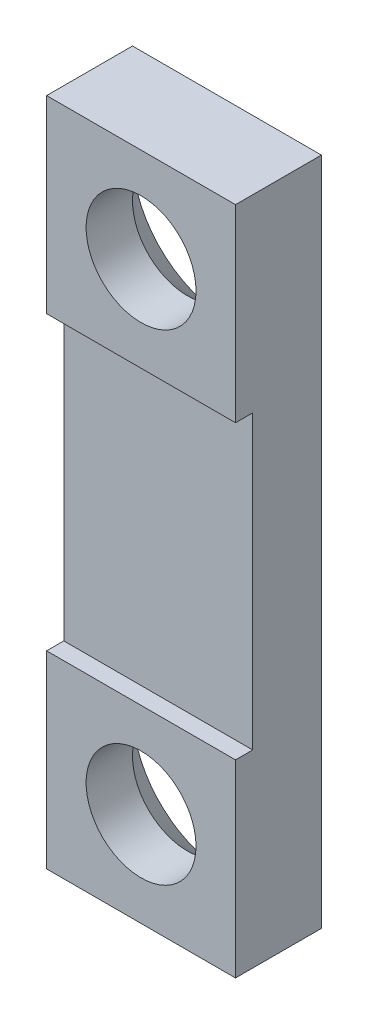
ISO-10303-21;
HEADER;
FILE_DESCRIPTION(('STEP AP214'),'2;1');
FILE_NAME('part.step','',(''),(''),'','','');
FILE_SCHEMA(('AUTOMOTIVE_DESIGN { 1 0 10303 214 1 1 1 1 }'));
ENDSEC;
DATA;
#1=APPLICATION_CONTEXT('core data for automotive mechanical design processes');
#2=APPLICATION_PROTOCOL_DEFINITION('international standard','automotive_design',2000,#1);
#3=PRODUCT_CONTEXT('',#1,'mechanical');
#4=PRODUCT('Part','Part','',(#3));
#5=PRODUCT_RELATED_PRODUCT_CATEGORY('part','',(#4));
#6=PRODUCT_DEFINITION_FORMATION('','',#4);
#7=PRODUCT_DEFINITION_CONTEXT('part definition',#1,'design');
#8=PRODUCT_DEFINITION('design','',#6,#7);
#9=PRODUCT_DEFINITION_SHAPE('','',#8);
#10=(LENGTH_UNIT() NAMED_UNIT(*) SI_UNIT(.MILLI.,.METRE.));
#11=(NAMED_UNIT(*) PLANE_ANGLE_UNIT() SI_UNIT($,.RADIAN.));
#12=(NAMED_UNIT(*) SI_UNIT($,.STERADIAN.) SOLID_ANGLE_UNIT());
#13=UNCERTAINTY_MEASURE_WITH_UNIT(LENGTH_MEASURE(1.E-05),#10,'distance_accuracy_value','');
#14=(GEOMETRIC_REPRESENTATION_CONTEXT(3) GLOBAL_UNCERTAINTY_ASSIGNED_CONTEXT((#13)) GLOBAL_UNIT_ASSIGNED_CONTEXT((#10,
#11,#12)) REPRESENTATION_CONTEXT('',''));
#15=CARTESIAN_POINT('',(0.,0.,0.));
#16=DIRECTION('',(0.,0.,1.));
#17=DIRECTION('',(1.,0.,0.));
#18=AXIS2_PLACEMENT_3D('',#15,#16,#17);
#19=CARTESIAN_POINT('',(0.,0.,0.));
#20=DIRECTION('',(0.,0.,1.));
#21=DIRECTION('',(1.,0.,0.));
#22=AXIS2_PLACEMENT_3D('',#19,#20,#21);
#23=PLANE('',#22);
#24=DIRECTION('',(0.,1.,0.));
#25=VECTOR('',#24,1.);
#26=CARTESIAN_POINT('',(2.75,0.,0.));
#27=LINE('',#26,#25);
#28=CARTESIAN_POINT('',(2.75,7.,0.));
#29=VERTEX_POINT('',#28);
#30=CARTESIAN_POINT('',(2.75,9.75,0.));
#31=VERTEX_POINT('',#30);
#32=EDGE_CURVE('E178',#29,#31,#27,.T.);
#33=ORIENTED_EDGE('',*,*,#32,.F.);
#34=CARTESIAN_POINT('',(0.,7.,0.));
#35=DIRECTION('',(0.,0.,1.));
#36=DIRECTION('',(1.,0.,0.));
#37=AXIS2_PLACEMENT_3D('',#34,#35,#36);
#38=CIRCLE('',#37,2.75);
#39=CARTESIAN_POINT('',(0.,9.75,0.));
#40=VERTEX_POINT('',#39);
#41=EDGE_CURVE('E224',#29,#40,#38,.T.);
#42=ORIENTED_EDGE('',*,*,#41,.T.);
#43=DIRECTION('',(1.,0.,0.));
#44=VECTOR('',#43,1.);
#45=CARTESIAN_POINT('',(0.,9.75,0.));
#46=LINE('',#45,#44);
#47=EDGE_CURVE('E165',#40,#31,#46,.T.);
#48=ORIENTED_EDGE('',*,*,#47,.T.);
#49=EDGE_LOOP('',(#33,#42,#48));
#50=FACE_BOUND('',#49,.T.);
#51=ADVANCED_FACE('F43',(#50),#23,.F.);
#52=CARTESIAN_POINT('',(-2.75,9.75,0.));
#53=VERTEX_POINT('',#52);
#54=EDGE_CURVE('E158',#53,#40,#46,.T.);
#55=ORIENTED_EDGE('',*,*,#54,.T.);
#56=CARTESIAN_POINT('',(0.,7.,0.));
#57=DIRECTION('',(0.,0.,1.));
#58=DIRECTION('',(1.,0.,0.));
#59=AXIS2_PLACEMENT_3D('',#56,#57,#58);
#60=CIRCLE('',#59,2.75);
#61=CARTESIAN_POINT('',(-2.75,7.,0.));
#62=VERTEX_POINT('',#61);
#63=EDGE_CURVE('E59',#40,#62,#60,.T.);
#64=ORIENTED_EDGE('',*,*,#63,.T.);
#65=DIRECTION('',(0.,1.,0.));
#66=VECTOR('',#65,1.);
#67=CARTESIAN_POINT('',(-2.75,0.,0.));
#68=LINE('',#67,#66);
#69=EDGE_CURVE('E197',#62,#53,#68,.T.);
#70=ORIENTED_EDGE('',*,*,#69,.T.);
#71=EDGE_LOOP('',(#55,#64,#70));
#72=FACE_BOUND('',#71,.T.);
#73=ADVANCED_FACE('F245',(#72),#23,.F.);
#74=CARTESIAN_POINT('',(-2.75,-7.,0.));
#75=VERTEX_POINT('',#74);
#76=EDGE_CURVE('E203',#75,#62,#68,.T.);
#77=ORIENTED_EDGE('',*,*,#76,.T.);
#78=CARTESIAN_POINT('',(0.,7.,0.));
#79=DIRECTION('',(0.,0.,1.));
#80=DIRECTION('',(1.,0.,0.));
#81=AXIS2_PLACEMENT_3D('',#78,#79,#80);
#82=CIRCLE('',#81,2.75);
#83=EDGE_CURVE('E221',#62,#29,#82,.T.);
#84=ORIENTED_EDGE('',*,*,#83,.T.);
#85=CARTESIAN_POINT('',(2.75,-7.,0.));
#86=VERTEX_POINT('',#85);
#87=EDGE_CURVE('E198',#86,#29,#27,.T.);
#88=ORIENTED_EDGE('',*,*,#87,.F.);
#89=CARTESIAN_POINT('',(0.,-7.,0.));
#90=DIRECTION('',(0.,0.,1.));
#91=DIRECTION('',(1.,0.,0.));
#92=AXIS2_PLACEMENT_3D('',#89,#90,#91);
#93=CIRCLE('',#92,2.75);
#94=EDGE_CURVE('E218',#86,#75,#93,.T.);
#95=ORIENTED_EDGE('',*,*,#94,.T.);
#96=EDGE_LOOP('',(#77,#84,#88,#95));
#97=FACE_BOUND('',#96,.T.);
#98=ADVANCED_FACE('F252',(#97),#23,.F.);
#99=CARTESIAN_POINT('',(-2.75,-9.75,0.));
#100=VERTEX_POINT('',#99);
#101=EDGE_CURVE('E199',#100,#75,#68,.T.);
#102=ORIENTED_EDGE('',*,*,#101,.T.);
#103=CARTESIAN_POINT('',(0.,-7.,0.));
#104=DIRECTION('',(0.,0.,1.));
#105=DIRECTION('',(1.,0.,0.));
#106=AXIS2_PLACEMENT_3D('',#103,#104,#105);
#107=CIRCLE('',#106,2.75);
#108=CARTESIAN_POINT('',(0.,-9.75,0.));
#109=VERTEX_POINT('',#108);
#110=EDGE_CURVE('E216',#75,#109,#107,.T.);
#111=ORIENTED_EDGE('',*,*,#110,.T.);
#112=DIRECTION('',(1.,0.,0.));
#113=VECTOR('',#112,1.);
#114=CARTESIAN_POINT('',(0.,-9.75,0.));
#115=LINE('',#114,#113);
#116=EDGE_CURVE('E182',#100,#109,#115,.T.);
#117=ORIENTED_EDGE('',*,*,#116,.F.);
#118=EDGE_LOOP('',(#102,#111,#117));
#119=FACE_BOUND('',#118,.T.);
#120=ADVANCED_FACE('F260',(#119),#23,.F.);
#121=CARTESIAN_POINT('',(2.75,0.,2.5));
#122=DIRECTION('',(-1.,0.,0.));
#123=DIRECTION('',(0.,-1.,0.));
#124=AXIS2_PLACEMENT_3D('',#121,#122,#123);
#125=PLANE('',#124);
#126=CARTESIAN_POINT('',(2.75,-9.75,0.));
#127=VERTEX_POINT('',#126);
#128=EDGE_CURVE('E194',#127,#86,#27,.T.);
#129=ORIENTED_EDGE('',*,*,#128,.T.);
#130=ORIENTED_EDGE('',*,*,#87,.T.);
#131=ORIENTED_EDGE('',*,*,#32,.T.);
#132=DIRECTION('',(0.,0.,-1.));
#133=VECTOR('',#132,1.);
#134=CARTESIAN_POINT('',(2.75,9.75,2.5));
#135=LINE('',#134,#133);
#136=CARTESIAN_POINT('',(2.75,9.75,2.5));
#137=VERTEX_POINT('',#136);
#138=EDGE_CURVE('E167',#137,#31,#135,.T.);
#139=ORIENTED_EDGE('',*,*,#138,.F.);
#140=DIRECTION('',(0.,1.,0.));
#141=VECTOR('',#140,1.);
#142=CARTESIAN_POINT('',(2.75,0.,2.5));
#143=LINE('',#142,#141);
#144=CARTESIAN_POINT('',(2.75,4.25,2.5));
#145=VERTEX_POINT('',#144);
#146=EDGE_CURVE('E150',#145,#137,#143,.T.);
#147=ORIENTED_EDGE('',*,*,#146,.F.);
#148=DIRECTION('',(0.,0.,-1.));
#149=VECTOR('',#148,1.);
#150=CARTESIAN_POINT('',(2.75,4.25,2.5));
#151=LINE('',#150,#149);
#152=CARTESIAN_POINT('',(2.75,4.25,2.));
#153=VERTEX_POINT('',#152);
#154=EDGE_CURVE('E142',#145,#153,#151,.T.);
#155=ORIENTED_EDGE('',*,*,#154,.T.);
#156=DIRECTION('',(0.,1.,0.));
#157=VECTOR('',#156,1.);
#158=CARTESIAN_POINT('',(2.75,0.,2.));
#159=LINE('',#158,#157);
#160=CARTESIAN_POINT('',(2.75,-4.25,2.));
#161=VERTEX_POINT('',#160);
#162=EDGE_CURVE('E176',#161,#153,#159,.T.);
#163=ORIENTED_EDGE('',*,*,#162,.F.);
#164=DIRECTION('',(0.,0.,-1.));
#165=VECTOR('',#164,1.);
#166=CARTESIAN_POINT('',(2.75,-4.25,2.5));
#167=LINE('',#166,#165);
#168=CARTESIAN_POINT('',(2.75,-4.25,2.5));
#169=VERTEX_POINT('',#168);
#170=EDGE_CURVE('E212',#169,#161,#167,.T.);
#171=ORIENTED_EDGE('',*,*,#170,.F.);
#172=DIRECTION('',(0.,1.,0.));
#173=VECTOR('',#172,1.);
#174=CARTESIAN_POINT('',(2.75,0.,2.5));
#175=LINE('',#174,#173);
#176=CARTESIAN_POINT('',(2.75,-9.75,2.5));
#177=VERTEX_POINT('',#176);
#178=EDGE_CURVE('E179',#177,#169,#175,.T.);
#179=ORIENTED_EDGE('',*,*,#178,.F.);
#180=DIRECTION('',(0.,0.,-1.));
#181=VECTOR('',#180,1.);
#182=CARTESIAN_POINT('',(2.75,-9.75,2.5));
#183=LINE('',#182,#181);
#184=EDGE_CURVE('E193',#177,#127,#183,.T.);
#185=ORIENTED_EDGE('',*,*,#184,.T.);
#186=EDGE_LOOP('',(#129,#130,#131,#139,#147,#155,#163,#171,#179,#185));
#187=FACE_BOUND('',#186,.T.);
#188=ADVANCED_FACE('F273',(#187),#125,.F.);
#189=CARTESIAN_POINT('',(0.,-4.25,2.5));
#190=DIRECTION('',(0.,1.,0.));
#191=DIRECTION('',(0.,0.,1.));
#192=AXIS2_PLACEMENT_3D('',#189,#190,#191);
#193=PLANE('',#192);
#194=DIRECTION('',(1.,0.,0.));
#195=VECTOR('',#194,1.);
#196=CARTESIAN_POINT('',(0.,-4.25,2.));
#197=LINE('',#196,#195);
#198=CARTESIAN_POINT('',(-2.75,-4.25,2.));
#199=VERTEX_POINT('',#198);
#200=EDGE_CURVE('E173',#199,#161,#197,.T.);
#201=ORIENTED_EDGE('',*,*,#200,.F.);
#202=DIRECTION('',(0.,0.,-1.));
#203=VECTOR('',#202,1.);
#204=CARTESIAN_POINT('',(-2.75,-4.25,2.5));
#205=LINE('',#204,#203);
#206=CARTESIAN_POINT('',(-2.75,-4.25,2.5));
#207=VERTEX_POINT('',#206);
#208=EDGE_CURVE('E210',#207,#199,#205,.T.);
#209=ORIENTED_EDGE('',*,*,#208,.F.);
#210=DIRECTION('',(1.,0.,0.));
#211=VECTOR('',#210,1.);
#212=CARTESIAN_POINT('',(0.,-4.25,2.5));
#213=LINE('',#212,#211);
#214=EDGE_CURVE('E181',#207,#169,#213,.T.);
#215=ORIENTED_EDGE('',*,*,#214,.T.);
#216=ORIENTED_EDGE('',*,*,#170,.T.);
#217=EDGE_LOOP('',(#201,#209,#215,#216));
#218=FACE_BOUND('',#217,.T.);
#219=ADVANCED_FACE('F279',(#218),#193,.T.);
#220=CARTESIAN_POINT('',(-2.75,0.,2.5));
#221=DIRECTION('',(-1.,0.,0.));
#222=DIRECTION('',(0.,-1.,0.));
#223=AXIS2_PLACEMENT_3D('',#220,#221,#222);
#224=PLANE('',#223);
#225=ORIENTED_EDGE('',*,*,#101,.F.);
#226=DIRECTION('',(0.,0.,-1.));
#227=VECTOR('',#226,1.);
#228=CARTESIAN_POINT('',(-2.75,-9.75,2.5));
#229=LINE('',#228,#227);
#230=CARTESIAN_POINT('',(-2.75,-9.75,2.5));
#231=VERTEX_POINT('',#230);
#232=EDGE_CURVE('E208',#231,#100,#229,.T.);
#233=ORIENTED_EDGE('',*,*,#232,.F.);
#234=DIRECTION('',(0.,1.,0.));
#235=VECTOR('',#234,1.);
#236=CARTESIAN_POINT('',(-2.75,0.,2.5));
#237=LINE('',#236,#235);
#238=EDGE_CURVE('E185',#231,#207,#237,.T.);
#239=ORIENTED_EDGE('',*,*,#238,.T.);
#240=ORIENTED_EDGE('',*,*,#208,.T.);
#241=DIRECTION('',(0.,1.,0.));
#242=VECTOR('',#241,1.);
#243=CARTESIAN_POINT('',(-2.75,0.,2.));
#244=LINE('',#243,#242);
#245=CARTESIAN_POINT('',(-2.75,4.25,2.));
#246=VERTEX_POINT('',#245);
#247=EDGE_CURVE('E138',#199,#246,#244,.T.);
#248=ORIENTED_EDGE('',*,*,#247,.T.);
#249=DIRECTION('',(0.,0.,-1.));
#250=VECTOR('',#249,1.);
#251=CARTESIAN_POINT('',(-2.75,4.25,2.5));
#252=LINE('',#251,#250);
#253=CARTESIAN_POINT('',(-2.75,4.25,2.5));
#254=VERTEX_POINT('',#253);
#255=EDGE_CURVE('E128',#254,#246,#252,.T.);
#256=ORIENTED_EDGE('',*,*,#255,.F.);
#257=DIRECTION('',(0.,1.,0.));
#258=VECTOR('',#257,1.);
#259=CARTESIAN_POINT('',(-2.75,0.,2.5));
#260=LINE('',#259,#258);
#261=CARTESIAN_POINT('',(-2.75,9.75,2.5));
#262=VERTEX_POINT('',#261);
#263=EDGE_CURVE('E134',#254,#262,#260,.T.);
#264=ORIENTED_EDGE('',*,*,#263,.T.);
#265=DIRECTION('',(0.,0.,-1.));
#266=VECTOR('',#265,1.);
#267=CARTESIAN_POINT('',(-2.75,9.75,2.5));
#268=LINE('',#267,#266);
#269=EDGE_CURVE('E163',#262,#53,#268,.T.);
#270=ORIENTED_EDGE('',*,*,#269,.T.);
#271=ORIENTED_EDGE('',*,*,#69,.F.);
#272=ORIENTED_EDGE('',*,*,#76,.F.);
#273=EDGE_LOOP('',(#225,#233,#239,#240,#248,#256,#264,#270,#271,#272));
#274=FACE_BOUND('',#273,.T.);
#275=ADVANCED_FACE('F131',(#274),#224,.T.);
#276=CARTESIAN_POINT('',(0.,-9.75,2.5));
#277=DIRECTION('',(0.,1.,0.));
#278=DIRECTION('',(0.,0.,1.));
#279=AXIS2_PLACEMENT_3D('',#276,#277,#278);
#280=PLANE('',#279);
#281=ORIENTED_EDGE('',*,*,#116,.T.);
#282=EDGE_CURVE('E202',#109,#127,#115,.T.);
#283=ORIENTED_EDGE('',*,*,#282,.T.);
#284=ORIENTED_EDGE('',*,*,#184,.F.);
#285=DIRECTION('',(1.,0.,0.));
#286=VECTOR('',#285,1.);
#287=CARTESIAN_POINT('',(0.,-9.75,2.5));
#288=LINE('',#287,#286);
#289=EDGE_CURVE('E188',#231,#177,#288,.T.);
#290=ORIENTED_EDGE('',*,*,#289,.F.);
#291=ORIENTED_EDGE('',*,*,#232,.T.);
#292=EDGE_LOOP('',(#281,#283,#284,#290,#291));
#293=FACE_BOUND('',#292,.T.);
#294=ADVANCED_FACE('F299',(#293),#280,.F.);
#295=CARTESIAN_POINT('',(0.,-7.,2.5));
#296=DIRECTION('',(0.,0.,-1.));
#297=DIRECTION('',(-1.,0.,0.));
#298=AXIS2_PLACEMENT_3D('',#295,#296,#297);
#299=CYLINDRICAL_SURFACE('',#298,1.6);
#300=CARTESIAN_POINT('',(0.,-7.,1.15));
#301=DIRECTION('',(0.,0.,1.));
#302=DIRECTION('',(1.,0.,0.));
#303=AXIS2_PLACEMENT_3D('',#300,#301,#302);
#304=CIRCLE('',#303,1.6);
#305=CARTESIAN_POINT('',(1.6,-7.,1.15));
#306=VERTEX_POINT('',#305);
#307=EDGE_CURVE('E11',#306,#306,#304,.F.);
#308=ORIENTED_EDGE('',*,*,#307,.T.);
#309=EDGE_LOOP('',(#308));
#310=FACE_BOUND('',#309,.T.);
#311=CARTESIAN_POINT('',(0.,-7.,2.5));
#312=DIRECTION('',(0.,0.,1.));
#313=DIRECTION('',(1.,0.,0.));
#314=AXIS2_PLACEMENT_3D('',#311,#312,#313);
#315=CIRCLE('',#314,1.6);
#316=CARTESIAN_POINT('',(1.6,-7.,2.5));
#317=VERTEX_POINT('',#316);
#318=EDGE_CURVE('E190',#317,#317,#315,.T.);
#319=ORIENTED_EDGE('',*,*,#318,.T.);
#320=EDGE_LOOP('',(#319));
#321=FACE_BOUND('',#320,.T.);
#322=ADVANCED_FACE('F269',(#310,#321),#299,.F.);
#323=CARTESIAN_POINT('',(0.,0.,2.5));
#324=DIRECTION('',(0.,0.,1.));
#325=DIRECTION('',(1.,0.,0.));
#326=AXIS2_PLACEMENT_3D('',#323,#324,#325);
#327=PLANE('',#326);
#328=ORIENTED_EDGE('',*,*,#178,.T.);
#329=ORIENTED_EDGE('',*,*,#214,.F.);
#330=ORIENTED_EDGE('',*,*,#238,.F.);
#331=ORIENTED_EDGE('',*,*,#289,.T.);
#332=EDGE_LOOP('',(#328,#329,#330,#331));
#333=FACE_BOUND('',#332,.T.);
#334=ORIENTED_EDGE('',*,*,#318,.F.);
#335=EDGE_LOOP('',(#334));
#336=FACE_BOUND('',#335,.T.);
#337=ADVANCED_FACE('F258',(#333,#336),#327,.T.);
#338=ORIENTED_EDGE('',*,*,#282,.F.);
#339=CARTESIAN_POINT('',(0.,-7.,0.));
#340=DIRECTION('',(0.,0.,1.));
#341=DIRECTION('',(1.,0.,0.));
#342=AXIS2_PLACEMENT_3D('',#339,#340,#341);
#343=CIRCLE('',#342,2.75);
#344=EDGE_CURVE('E214',#109,#86,#343,.T.);
#345=ORIENTED_EDGE('',*,*,#344,.T.);
#346=ORIENTED_EDGE('',*,*,#128,.F.);
#347=EDGE_LOOP('',(#338,#345,#346));
#348=FACE_BOUND('',#347,.T.);
#349=ADVANCED_FACE('F248',(#348),#23,.F.);
#350=CARTESIAN_POINT('',(0.,0.,2.));
#351=DIRECTION('',(0.,0.,1.));
#352=DIRECTION('',(1.,0.,0.));
#353=AXIS2_PLACEMENT_3D('',#350,#351,#352);
#354=PLANE('',#353);
#355=DIRECTION('',(1.,0.,0.));
#356=VECTOR('',#355,1.);
#357=CARTESIAN_POINT('',(0.,4.25,2.));
#358=LINE('',#357,#356);
#359=EDGE_CURVE('E141',#246,#153,#358,.T.);
#360=ORIENTED_EDGE('',*,*,#359,.F.);
#361=ORIENTED_EDGE('',*,*,#247,.F.);
#362=ORIENTED_EDGE('',*,*,#200,.T.);
#363=ORIENTED_EDGE('',*,*,#162,.T.);
#364=EDGE_LOOP('',(#360,#361,#362,#363));
#365=FACE_BOUND('',#364,.T.);
#366=ADVANCED_FACE('F257',(#365),#354,.T.);
#367=CARTESIAN_POINT('',(0.,4.25,2.5));
#368=DIRECTION('',(0.,1.,0.));
#369=DIRECTION('',(0.,0.,1.));
#370=AXIS2_PLACEMENT_3D('',#367,#368,#369);
#371=PLANE('',#370);
#372=ORIENTED_EDGE('',*,*,#255,.T.);
#373=ORIENTED_EDGE('',*,*,#359,.T.);
#374=ORIENTED_EDGE('',*,*,#154,.F.);
#375=DIRECTION('',(1.,0.,0.));
#376=VECTOR('',#375,1.);
#377=CARTESIAN_POINT('',(0.,4.25,2.5));
#378=LINE('',#377,#376);
#379=EDGE_CURVE('E146',#254,#145,#378,.T.);
#380=ORIENTED_EDGE('',*,*,#379,.F.);
#381=EDGE_LOOP('',(#372,#373,#374,#380));
#382=FACE_BOUND('',#381,.T.);
#383=ADVANCED_FACE('F147',(#382),#371,.F.);
#384=CARTESIAN_POINT('',(0.,7.,2.5));
#385=DIRECTION('',(0.,0.,-1.));
#386=DIRECTION('',(-1.,0.,0.));
#387=AXIS2_PLACEMENT_3D('',#384,#385,#386);
#388=CYLINDRICAL_SURFACE('',#387,1.6);
#389=CARTESIAN_POINT('',(0.,7.,1.15));
#390=DIRECTION('',(0.,0.,1.));
#391=DIRECTION('',(1.,0.,0.));
#392=AXIS2_PLACEMENT_3D('',#389,#390,#391);
#393=CIRCLE('',#392,1.6);
#394=CARTESIAN_POINT('',(1.6,7.,1.15));
#395=VERTEX_POINT('',#394);
#396=EDGE_CURVE('E52',#395,#395,#393,.F.);
#397=ORIENTED_EDGE('',*,*,#396,.T.);
#398=EDGE_LOOP('',(#397));
#399=FACE_BOUND('',#398,.T.);
#400=CARTESIAN_POINT('',(0.,7.,2.5));
#401=DIRECTION('',(0.,0.,1.));
#402=DIRECTION('',(1.,0.,0.));
#403=AXIS2_PLACEMENT_3D('',#400,#401,#402);
#404=CIRCLE('',#403,1.6);
#405=CARTESIAN_POINT('',(1.6,7.,2.5));
#406=VERTEX_POINT('',#405);
#407=EDGE_CURVE('E155',#406,#406,#404,.T.);
#408=ORIENTED_EDGE('',*,*,#407,.T.);
#409=EDGE_LOOP('',(#408));
#410=FACE_BOUND('',#409,.T.);
#411=ADVANCED_FACE('F228',(#399,#410),#388,.F.);
#412=CARTESIAN_POINT('',(0.,9.75,2.5));
#413=DIRECTION('',(0.,1.,0.));
#414=DIRECTION('',(0.,0.,1.));
#415=AXIS2_PLACEMENT_3D('',#412,#413,#414);
#416=PLANE('',#415);
#417=ORIENTED_EDGE('',*,*,#54,.F.);
#418=ORIENTED_EDGE('',*,*,#269,.F.);
#419=DIRECTION('',(1.,0.,0.));
#420=VECTOR('',#419,1.);
#421=CARTESIAN_POINT('',(0.,9.75,2.5));
#422=LINE('',#421,#420);
#423=EDGE_CURVE('E154',#262,#137,#422,.T.);
#424=ORIENTED_EDGE('',*,*,#423,.T.);
#425=ORIENTED_EDGE('',*,*,#138,.T.);
#426=ORIENTED_EDGE('',*,*,#47,.F.);
#427=EDGE_LOOP('',(#417,#418,#424,#425,#426));
#428=FACE_BOUND('',#427,.T.);
#429=ADVANCED_FACE('F239',(#428),#416,.T.);
#430=CARTESIAN_POINT('',(0.,0.,2.5));
#431=DIRECTION('',(0.,0.,1.));
#432=DIRECTION('',(1.,0.,0.));
#433=AXIS2_PLACEMENT_3D('',#430,#431,#432);
#434=PLANE('',#433);
#435=ORIENTED_EDGE('',*,*,#407,.F.);
#436=EDGE_LOOP('',(#435));
#437=FACE_BOUND('',#436,.T.);
#438=ORIENTED_EDGE('',*,*,#263,.F.);
#439=ORIENTED_EDGE('',*,*,#379,.T.);
#440=ORIENTED_EDGE('',*,*,#146,.T.);
#441=ORIENTED_EDGE('',*,*,#423,.F.);
#442=EDGE_LOOP('',(#438,#439,#440,#441));
#443=FACE_BOUND('',#442,.T.);
#444=ADVANCED_FACE('F152',(#437,#443),#434,.T.);
#445=CARTESIAN_POINT('',(0.,7.,0.));
#446=DIRECTION('',(0.,0.,-1.));
#447=DIRECTION('',(-1.,0.,0.));
#448=AXIS2_PLACEMENT_3D('',#445,#446,#447);
#449=CONICAL_SURFACE('',#448,2.75,0.785398163397446);
#450=ORIENTED_EDGE('',*,*,#396,.F.);
#451=EDGE_LOOP('',(#450));
#452=FACE_BOUND('',#451,.T.);
#453=ORIENTED_EDGE('',*,*,#63,.F.);
#454=ORIENTED_EDGE('',*,*,#41,.F.);
#455=ORIENTED_EDGE('',*,*,#83,.F.);
#456=EDGE_LOOP('',(#453,#454,#455));
#457=FACE_BOUND('',#456,.T.);
#458=ADVANCED_FACE('F231',(#452,#457),#449,.F.);
#459=CARTESIAN_POINT('',(0.,-7.,0.));
#460=DIRECTION('',(0.,0.,-1.));
#461=DIRECTION('',(-1.,0.,0.));
#462=AXIS2_PLACEMENT_3D('',#459,#460,#461);
#463=CONICAL_SURFACE('',#462,2.75,0.785398163397446);
#464=ORIENTED_EDGE('',*,*,#307,.F.);
#465=EDGE_LOOP('',(#464));
#466=FACE_BOUND('',#465,.T.);
#467=ORIENTED_EDGE('',*,*,#110,.F.);
#468=ORIENTED_EDGE('',*,*,#94,.F.);
#469=ORIENTED_EDGE('',*,*,#344,.F.);
#470=EDGE_LOOP('',(#467,#468,#469));
#471=FACE_BOUND('',#470,.T.);
#472=ADVANCED_FACE('F46',(#466,#471),#463,.F.);
#473=CLOSED_SHELL('',(#51,#73,#98,#120,#188,#219,#275,#294,#322,#337,#349,#366,#383,#411,#429,
#444,#458,#472));
#474=MANIFOLD_SOLID_BREP('B2',#473);
#475=ADVANCED_BREP_SHAPE_REPRESENTATION('',(#18,#474),#14);
#476=SHAPE_DEFINITION_REPRESENTATION(#9,#475);
ENDSEC;
END-ISO-10303-21;
